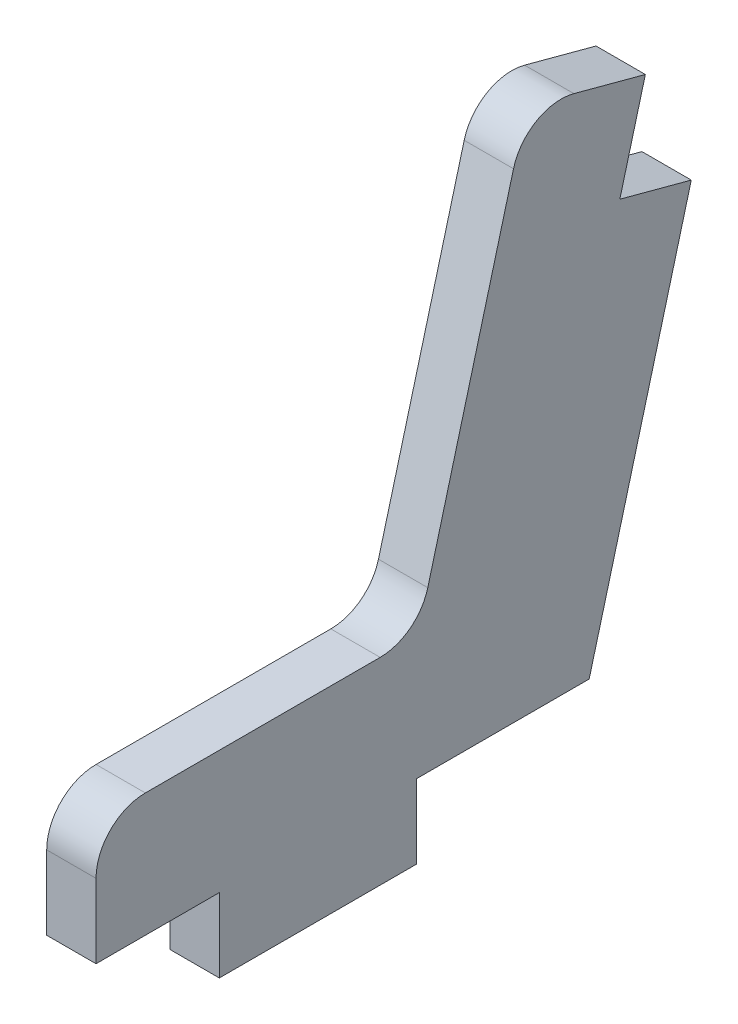
ISO-10303-21;
HEADER;
FILE_DESCRIPTION(('STEP AP214'),'2;1');
FILE_NAME('part.step','',(''),(''),'','','');
FILE_SCHEMA(('AUTOMOTIVE_DESIGN { 1 0 10303 214 1 1 1 1 }'));
ENDSEC;
DATA;
#1=APPLICATION_CONTEXT('core data for automotive mechanical design processes');
#2=APPLICATION_PROTOCOL_DEFINITION('international standard','automotive_design',2000,#1);
#3=PRODUCT_CONTEXT('',#1,'mechanical');
#4=PRODUCT('Part','Part','',(#3));
#5=PRODUCT_RELATED_PRODUCT_CATEGORY('part','',(#4));
#6=PRODUCT_DEFINITION_FORMATION('','',#4);
#7=PRODUCT_DEFINITION_CONTEXT('part definition',#1,'design');
#8=PRODUCT_DEFINITION('design','',#6,#7);
#9=PRODUCT_DEFINITION_SHAPE('','',#8);
#10=(LENGTH_UNIT() NAMED_UNIT(*) SI_UNIT(.MILLI.,.METRE.));
#11=(NAMED_UNIT(*) PLANE_ANGLE_UNIT() SI_UNIT($,.RADIAN.));
#12=(NAMED_UNIT(*) SI_UNIT($,.STERADIAN.) SOLID_ANGLE_UNIT());
#13=UNCERTAINTY_MEASURE_WITH_UNIT(LENGTH_MEASURE(1.E-05),#10,'distance_accuracy_value','');
#14=(GEOMETRIC_REPRESENTATION_CONTEXT(3) GLOBAL_UNCERTAINTY_ASSIGNED_CONTEXT((#13)) GLOBAL_UNIT_ASSIGNED_CONTEXT((#10,
#11,#12)) REPRESENTATION_CONTEXT('',''));
#15=CARTESIAN_POINT('',(0.,0.,0.));
#16=DIRECTION('',(0.,0.,1.));
#17=DIRECTION('',(1.,0.,0.));
#18=AXIS2_PLACEMENT_3D('',#15,#16,#17);
#19=CARTESIAN_POINT('',(2.,-7.70521967838386,20.5003652212126));
#20=DIRECTION('',(0.,0.,-1.));
#21=DIRECTION('',(-1.,0.,0.));
#22=AXIS2_PLACEMENT_3D('',#19,#20,#21);
#23=PLANE('',#22);
#24=DIRECTION('',(0.,-1.,0.));
#25=VECTOR('',#24,1.);
#26=CARTESIAN_POINT('',(2.,-7.70521967838386,20.5003652212126));
#27=LINE('',#26,#25);
#28=CARTESIAN_POINT('',(2.,-9.70521967838386,20.5003652212126));
#29=VERTEX_POINT('',#28);
#30=CARTESIAN_POINT('',(2.,-12.7052196783839,20.5003652212126));
#31=VERTEX_POINT('',#30);
#32=EDGE_CURVE('E144',#29,#31,#27,.T.);
#33=ORIENTED_EDGE('',*,*,#32,.F.);
#34=DIRECTION('',(-1.,0.,0.));
#35=VECTOR('',#34,1.);
#36=CARTESIAN_POINT('',(2.,-9.70521967838386,20.5003652212126));
#37=LINE('',#36,#35);
#38=CARTESIAN_POINT('',(0.,-9.70521967838386,20.5003652212126));
#39=VERTEX_POINT('',#38);
#40=EDGE_CURVE('E318',#29,#39,#37,.T.);
#41=ORIENTED_EDGE('',*,*,#40,.T.);
#42=DIRECTION('',(0.,-1.,0.));
#43=VECTOR('',#42,1.);
#44=CARTESIAN_POINT('',(0.,-7.70521967838386,20.5003652212126));
#45=LINE('',#44,#43);
#46=CARTESIAN_POINT('',(0.,-12.7052196783839,20.5003652212126));
#47=VERTEX_POINT('',#46);
#48=EDGE_CURVE('E170',#39,#47,#45,.T.);
#49=ORIENTED_EDGE('',*,*,#48,.T.);
#50=DIRECTION('',(-1.,0.,0.));
#51=VECTOR('',#50,1.);
#52=CARTESIAN_POINT('',(2.,-12.7052196783839,20.5003652212126));
#53=LINE('',#52,#51);
#54=EDGE_CURVE('E162',#31,#47,#53,.T.);
#55=ORIENTED_EDGE('',*,*,#54,.F.);
#56=EDGE_LOOP('',(#33,#41,#49,#55));
#57=FACE_BOUND('',#56,.T.);
#58=ADVANCED_FACE('F38',(#57),#23,.F.);
#59=CARTESIAN_POINT('',(2.,-12.7052196783839,20.5003652212126));
#60=DIRECTION('',(0.,1.,0.));
#61=DIRECTION('',(0.,0.,1.));
#62=AXIS2_PLACEMENT_3D('',#59,#60,#61);
#63=PLANE('',#62);
#64=DIRECTION('',(0.,0.,-1.));
#65=VECTOR('',#64,1.);
#66=CARTESIAN_POINT('',(0.,-12.7052196783839,20.5003652212126));
#67=LINE('',#66,#65);
#68=CARTESIAN_POINT('',(0.,-12.7052196783839,15.5003652212126));
#69=VERTEX_POINT('',#68);
#70=EDGE_CURVE('E248',#47,#69,#67,.T.);
#71=ORIENTED_EDGE('',*,*,#70,.T.);
#72=DIRECTION('',(-1.,0.,0.));
#73=VECTOR('',#72,1.);
#74=CARTESIAN_POINT('',(2.,-12.7052196783839,15.5003652212126));
#75=LINE('',#74,#73);
#76=CARTESIAN_POINT('',(2.,-12.7052196783839,15.5003652212126));
#77=VERTEX_POINT('',#76);
#78=EDGE_CURVE('E164',#77,#69,#75,.T.);
#79=ORIENTED_EDGE('',*,*,#78,.F.);
#80=DIRECTION('',(0.,0.,-1.));
#81=VECTOR('',#80,1.);
#82=CARTESIAN_POINT('',(2.,-12.7052196783839,20.5003652212126));
#83=LINE('',#82,#81);
#84=EDGE_CURVE('E148',#31,#77,#83,.T.);
#85=ORIENTED_EDGE('',*,*,#84,.F.);
#86=ORIENTED_EDGE('',*,*,#54,.T.);
#87=EDGE_LOOP('',(#71,#79,#85,#86));
#88=FACE_BOUND('',#87,.T.);
#89=ADVANCED_FACE('F161',(#88),#63,.F.);
#90=CARTESIAN_POINT('',(2.,-12.7052196783839,15.5003652212126));
#91=DIRECTION('',(0.,0.,-1.));
#92=DIRECTION('',(0.,1.,0.));
#93=AXIS2_PLACEMENT_3D('',#90,#91,#92);
#94=PLANE('',#93);
#95=DIRECTION('',(0.,-1.,0.));
#96=VECTOR('',#95,1.);
#97=CARTESIAN_POINT('',(0.,-12.7052196783839,15.5003652212126));
#98=LINE('',#97,#96);
#99=CARTESIAN_POINT('',(0.,-15.7052196783839,15.5003652212126));
#100=VERTEX_POINT('',#99);
#101=EDGE_CURVE('E250',#69,#100,#98,.T.);
#102=ORIENTED_EDGE('',*,*,#101,.T.);
#103=DIRECTION('',(-1.,0.,0.));
#104=VECTOR('',#103,1.);
#105=CARTESIAN_POINT('',(2.,-15.7052196783839,15.5003652212126));
#106=LINE('',#105,#104);
#107=CARTESIAN_POINT('',(2.,-15.7052196783839,15.5003652212126));
#108=VERTEX_POINT('',#107);
#109=EDGE_CURVE('E176',#108,#100,#106,.T.);
#110=ORIENTED_EDGE('',*,*,#109,.F.);
#111=DIRECTION('',(0.,-1.,0.));
#112=VECTOR('',#111,1.);
#113=CARTESIAN_POINT('',(2.,-12.7052196783839,15.5003652212126));
#114=LINE('',#113,#112);
#115=EDGE_CURVE('E167',#77,#108,#114,.T.);
#116=ORIENTED_EDGE('',*,*,#115,.F.);
#117=ORIENTED_EDGE('',*,*,#78,.T.);
#118=EDGE_LOOP('',(#102,#110,#116,#117));
#119=FACE_BOUND('',#118,.T.);
#120=ADVANCED_FACE('F331',(#119),#94,.F.);
#121=CARTESIAN_POINT('',(2.,-15.7052196783839,15.5003652212126));
#122=DIRECTION('',(0.,1.,0.));
#123=DIRECTION('',(0.,0.,1.));
#124=AXIS2_PLACEMENT_3D('',#121,#122,#123);
#125=PLANE('',#124);
#126=DIRECTION('',(0.,0.,-1.));
#127=VECTOR('',#126,1.);
#128=CARTESIAN_POINT('',(0.,-15.7052196783839,15.5003652212126));
#129=LINE('',#128,#127);
#130=CARTESIAN_POINT('',(0.,-15.7052196783839,7.50036522121258));
#131=VERTEX_POINT('',#130);
#132=EDGE_CURVE('E252',#100,#131,#129,.T.);
#133=ORIENTED_EDGE('',*,*,#132,.T.);
#134=DIRECTION('',(-1.,0.,0.));
#135=VECTOR('',#134,1.);
#136=CARTESIAN_POINT('',(2.,-15.7052196783839,7.50036522121258));
#137=LINE('',#136,#135);
#138=CARTESIAN_POINT('',(2.,-15.7052196783839,7.50036522121258));
#139=VERTEX_POINT('',#138);
#140=EDGE_CURVE('E285',#139,#131,#137,.T.);
#141=ORIENTED_EDGE('',*,*,#140,.F.);
#142=DIRECTION('',(0.,0.,-1.));
#143=VECTOR('',#142,1.);
#144=CARTESIAN_POINT('',(2.,-15.7052196783839,15.5003652212126));
#145=LINE('',#144,#143);
#146=EDGE_CURVE('E207',#108,#139,#145,.T.);
#147=ORIENTED_EDGE('',*,*,#146,.F.);
#148=ORIENTED_EDGE('',*,*,#109,.T.);
#149=EDGE_LOOP('',(#133,#141,#147,#148));
#150=FACE_BOUND('',#149,.T.);
#151=ADVANCED_FACE('F292',(#150),#125,.F.);
#152=CARTESIAN_POINT('',(2.,-15.7052196783839,7.50036522121258));
#153=DIRECTION('',(0.,0.,1.));
#154=DIRECTION('',(1.,0.,0.));
#155=AXIS2_PLACEMENT_3D('',#152,#153,#154);
#156=PLANE('',#155);
#157=DIRECTION('',(0.,1.,0.));
#158=VECTOR('',#157,1.);
#159=CARTESIAN_POINT('',(0.,-15.7052196783839,7.50036522121258));
#160=LINE('',#159,#158);
#161=CARTESIAN_POINT('',(0.,-12.7052196783839,7.50036522121258));
#162=VERTEX_POINT('',#161);
#163=EDGE_CURVE('E254',#131,#162,#160,.T.);
#164=ORIENTED_EDGE('',*,*,#163,.T.);
#165=DIRECTION('',(-1.,0.,0.));
#166=VECTOR('',#165,1.);
#167=CARTESIAN_POINT('',(2.,-12.7052196783839,7.50036522121258));
#168=LINE('',#167,#166);
#169=CARTESIAN_POINT('',(2.,-12.7052196783839,7.50036522121258));
#170=VERTEX_POINT('',#169);
#171=EDGE_CURVE('E282',#170,#162,#168,.T.);
#172=ORIENTED_EDGE('',*,*,#171,.F.);
#173=DIRECTION('',(0.,1.,0.));
#174=VECTOR('',#173,1.);
#175=CARTESIAN_POINT('',(2.,-15.7052196783839,7.50036522121258));
#176=LINE('',#175,#174);
#177=EDGE_CURVE('E215',#139,#170,#176,.T.);
#178=ORIENTED_EDGE('',*,*,#177,.F.);
#179=ORIENTED_EDGE('',*,*,#140,.T.);
#180=EDGE_LOOP('',(#164,#172,#178,#179));
#181=FACE_BOUND('',#180,.T.);
#182=ADVANCED_FACE('F304',(#181),#156,.F.);
#183=CARTESIAN_POINT('',(2.,-12.7052196783839,7.50036522121258));
#184=DIRECTION('',(0.,1.,0.));
#185=DIRECTION('',(0.,0.,1.));
#186=AXIS2_PLACEMENT_3D('',#183,#184,#185);
#187=PLANE('',#186);
#188=DIRECTION('',(0.,0.,-1.));
#189=VECTOR('',#188,1.);
#190=CARTESIAN_POINT('',(0.,-12.7052196783839,7.50036522121258));
#191=LINE('',#190,#189);
#192=CARTESIAN_POINT('',(0.,-12.7052196783839,0.500365221212583));
#193=VERTEX_POINT('',#192);
#194=EDGE_CURVE('E256',#162,#193,#191,.T.);
#195=ORIENTED_EDGE('',*,*,#194,.T.);
#196=DIRECTION('',(-1.,0.,0.));
#197=VECTOR('',#196,1.);
#198=CARTESIAN_POINT('',(2.,-12.7052196783839,0.500365221212583));
#199=LINE('',#198,#197);
#200=CARTESIAN_POINT('',(2.,-12.7052196783839,0.500365221212583));
#201=VERTEX_POINT('',#200);
#202=EDGE_CURVE('E279',#201,#193,#199,.T.);
#203=ORIENTED_EDGE('',*,*,#202,.F.);
#204=DIRECTION('',(0.,0.,-1.));
#205=VECTOR('',#204,1.);
#206=CARTESIAN_POINT('',(2.,-12.7052196783839,7.50036522121258));
#207=LINE('',#206,#205);
#208=EDGE_CURVE('E218',#170,#201,#207,.T.);
#209=ORIENTED_EDGE('',*,*,#208,.F.);
#210=ORIENTED_EDGE('',*,*,#171,.T.);
#211=EDGE_LOOP('',(#195,#203,#209,#210));
#212=FACE_BOUND('',#211,.T.);
#213=ADVANCED_FACE('F308',(#212),#187,.F.);
#214=CARTESIAN_POINT('',(2.,-12.7052196783839,0.500365221212583));
#215=DIRECTION('',(0.,0.258819045102518,0.965925826289069));
#216=DIRECTION('',(0.,-0.965925826289069,0.258819045102518));
#217=AXIS2_PLACEMENT_3D('',#214,#215,#216);
#218=PLANE('',#217);
#219=DIRECTION('',(0.,0.965925826289069,-0.258819045102518));
#220=VECTOR('',#219,1.);
#221=CARTESIAN_POINT('',(0.,-12.7052196783839,0.500365221212583));
#222=LINE('',#221,#220);
#223=CARTESIAN_POINT('',(0.,2.74959354224125,-3.6407395004277));
#224=VERTEX_POINT('',#223);
#225=EDGE_CURVE('E258',#193,#224,#222,.T.);
#226=ORIENTED_EDGE('',*,*,#225,.T.);
#227=DIRECTION('',(-1.,0.,0.));
#228=VECTOR('',#227,1.);
#229=CARTESIAN_POINT('',(2.,2.74959354224125,-3.6407395004277));
#230=LINE('',#229,#228);
#231=CARTESIAN_POINT('',(2.,2.74959354224125,-3.6407395004277));
#232=VERTEX_POINT('',#231);
#233=EDGE_CURVE('E276',#232,#224,#230,.T.);
#234=ORIENTED_EDGE('',*,*,#233,.F.);
#235=DIRECTION('',(0.,0.965925826289069,-0.258819045102518));
#236=VECTOR('',#235,1.);
#237=CARTESIAN_POINT('',(2.,-12.7052196783839,0.500365221212583));
#238=LINE('',#237,#236);
#239=EDGE_CURVE('E222',#201,#232,#238,.T.);
#240=ORIENTED_EDGE('',*,*,#239,.F.);
#241=ORIENTED_EDGE('',*,*,#202,.T.);
#242=EDGE_LOOP('',(#226,#234,#240,#241));
#243=FACE_BOUND('',#242,.T.);
#244=ADVANCED_FACE('F431',(#243),#218,.F.);
#245=CARTESIAN_POINT('',(2.,2.74959354224125,-3.6407395004277));
#246=DIRECTION('',(0.,-0.965925826289069,0.258819045102518));
#247=DIRECTION('',(0.,-0.258819045102518,-0.965925826289069));
#248=AXIS2_PLACEMENT_3D('',#245,#246,#247);
#249=PLANE('',#248);
#250=DIRECTION('',(0.,0.258819045102518,0.965925826289069));
#251=VECTOR('',#250,1.);
#252=CARTESIAN_POINT('',(0.,2.74959354224125,-3.6407395004277));
#253=LINE('',#252,#251);
#254=CARTESIAN_POINT('',(0.,3.5260506775488,-0.742962021560494));
#255=VERTEX_POINT('',#254);
#256=EDGE_CURVE('E260',#224,#255,#253,.T.);
#257=ORIENTED_EDGE('',*,*,#256,.T.);
#258=DIRECTION('',(-1.,0.,0.));
#259=VECTOR('',#258,1.);
#260=CARTESIAN_POINT('',(2.,3.5260506775488,-0.742962021560494));
#261=LINE('',#260,#259);
#262=CARTESIAN_POINT('',(2.,3.5260506775488,-0.742962021560494));
#263=VERTEX_POINT('',#262);
#264=EDGE_CURVE('E273',#263,#255,#261,.T.);
#265=ORIENTED_EDGE('',*,*,#264,.F.);
#266=DIRECTION('',(0.,0.258819045102518,0.965925826289069));
#267=VECTOR('',#266,1.);
#268=CARTESIAN_POINT('',(2.,2.74959354224125,-3.6407395004277));
#269=LINE('',#268,#267);
#270=EDGE_CURVE('E226',#232,#263,#269,.T.);
#271=ORIENTED_EDGE('',*,*,#270,.F.);
#272=ORIENTED_EDGE('',*,*,#233,.T.);
#273=EDGE_LOOP('',(#257,#265,#271,#272));
#274=FACE_BOUND('',#273,.T.);
#275=ADVANCED_FACE('F421',(#274),#249,.F.);
#276=CARTESIAN_POINT('',(2.,3.5260506775488,-0.742962021560494));
#277=DIRECTION('',(0.,0.258819045102518,0.965925826289069));
#278=DIRECTION('',(0.,-0.965925826289069,0.258819045102518));
#279=AXIS2_PLACEMENT_3D('',#276,#277,#278);
#280=PLANE('',#279);
#281=DIRECTION('',(0.,0.965925826289069,-0.258819045102518));
#282=VECTOR('',#281,1.);
#283=CARTESIAN_POINT('',(0.,3.5260506775488,-0.742962021560494));
#284=LINE('',#283,#282);
#285=CARTESIAN_POINT('',(0.,7.38975398270508,-1.77823820197056));
#286=VERTEX_POINT('',#285);
#287=EDGE_CURVE('E262',#255,#286,#284,.T.);
#288=ORIENTED_EDGE('',*,*,#287,.T.);
#289=DIRECTION('',(-1.,0.,0.));
#290=VECTOR('',#289,1.);
#291=CARTESIAN_POINT('',(2.,7.38975398270508,-1.77823820197056));
#292=LINE('',#291,#290);
#293=CARTESIAN_POINT('',(2.,7.38975398270508,-1.77823820197056));
#294=VERTEX_POINT('',#293);
#295=EDGE_CURVE('E246',#294,#286,#292,.T.);
#296=ORIENTED_EDGE('',*,*,#295,.F.);
#297=DIRECTION('',(0.,0.965925826289069,-0.258819045102518));
#298=VECTOR('',#297,1.);
#299=CARTESIAN_POINT('',(2.,3.5260506775488,-0.742962021560494));
#300=LINE('',#299,#298);
#301=EDGE_CURVE('E229',#263,#294,#300,.T.);
#302=ORIENTED_EDGE('',*,*,#301,.F.);
#303=ORIENTED_EDGE('',*,*,#264,.T.);
#304=EDGE_LOOP('',(#288,#296,#302,#303));
#305=FACE_BOUND('',#304,.T.);
#306=ADVANCED_FACE('F405',(#305),#280,.F.);
#307=CARTESIAN_POINT('',(2.,7.38975398270508,-1.77823820197056));
#308=DIRECTION('',(0.,-0.965925826289069,0.258819045102518));
#309=DIRECTION('',(0.,-0.258819045102518,-0.965925826289069));
#310=AXIS2_PLACEMENT_3D('',#307,#308,#309);
#311=PLANE('',#310);
#312=DIRECTION('',(0.,0.258819045102518,0.965925826289069));
#313=VECTOR('',#312,1.);
#314=CARTESIAN_POINT('',(0.,7.38975398270508,-1.77823820197056));
#315=LINE('',#314,#313);
#316=CARTESIAN_POINT('',(0.,8.16621111801263,1.11953927689664));
#317=VERTEX_POINT('',#316);
#318=EDGE_CURVE('E264',#286,#317,#315,.T.);
#319=ORIENTED_EDGE('',*,*,#318,.T.);
#320=DIRECTION('',(-1.,0.,0.));
#321=VECTOR('',#320,1.);
#322=CARTESIAN_POINT('',(2.,8.16621111801263,1.11953927689664));
#323=LINE('',#322,#321);
#324=CARTESIAN_POINT('',(2.,8.16621111801263,1.11953927689664));
#325=VERTEX_POINT('',#324);
#326=EDGE_CURVE('E186',#317,#325,#323,.F.);
#327=ORIENTED_EDGE('',*,*,#326,.T.);
#328=DIRECTION('',(0.,0.258819045102518,0.965925826289069));
#329=VECTOR('',#328,1.);
#330=CARTESIAN_POINT('',(2.,7.38975398270508,-1.77823820197056));
#331=LINE('',#330,#329);
#332=EDGE_CURVE('E233',#294,#325,#331,.T.);
#333=ORIENTED_EDGE('',*,*,#332,.F.);
#334=ORIENTED_EDGE('',*,*,#295,.T.);
#335=EDGE_LOOP('',(#319,#327,#333,#334));
#336=FACE_BOUND('',#335,.T.);
#337=ADVANCED_FACE('F397',(#336),#311,.F.);
#338=CARTESIAN_POINT('',(2.,8.68384920821767,3.05139092947478));
#339=DIRECTION('',(0.,-0.258819045102517,-0.965925826289069));
#340=DIRECTION('',(0.,0.965925826289069,-0.258819045102517));
#341=AXIS2_PLACEMENT_3D('',#338,#339,#340);
#342=PLANE('',#341);
#343=DIRECTION('',(0.,-0.965925826289069,0.258819045102517));
#344=VECTOR('',#343,1.);
#345=CARTESIAN_POINT('',(2.,8.68384920821767,3.05139092947478));
#346=LINE('',#345,#344);
#347=CARTESIAN_POINT('',(2.,6.75199755563953,3.56902901967982));
#348=VERTEX_POINT('',#347);
#349=CARTESIAN_POINT('',(2.,-6.2228577685889,7.04563102571742));
#350=VERTEX_POINT('',#349);
#351=EDGE_CURVE('E237',#348,#350,#346,.T.);
#352=ORIENTED_EDGE('',*,*,#351,.F.);
#353=DIRECTION('',(-1.,0.,0.));
#354=VECTOR('',#353,1.);
#355=CARTESIAN_POINT('',(2.,6.75199755563953,3.56902901967982));
#356=LINE('',#355,#354);
#357=CARTESIAN_POINT('',(0.,6.75199755563953,3.56902901967982));
#358=VERTEX_POINT('',#357);
#359=EDGE_CURVE('E174',#348,#358,#356,.T.);
#360=ORIENTED_EDGE('',*,*,#359,.T.);
#361=DIRECTION('',(0.,-0.965925826289069,0.258819045102517));
#362=VECTOR('',#361,1.);
#363=CARTESIAN_POINT('',(0.,8.68384920821767,3.05139092947478));
#364=LINE('',#363,#362);
#365=CARTESIAN_POINT('',(0.,-6.2228577685889,7.04563102571742));
#366=VERTEX_POINT('',#365);
#367=EDGE_CURVE('E267',#358,#366,#364,.T.);
#368=ORIENTED_EDGE('',*,*,#367,.T.);
#369=DIRECTION('',(-1.,0.,0.));
#370=VECTOR('',#369,1.);
#371=CARTESIAN_POINT('',(2.,-6.22285776858889,7.04563102571742));
#372=LINE('',#371,#370);
#373=EDGE_CURVE('E172',#366,#350,#372,.F.);
#374=ORIENTED_EDGE('',*,*,#373,.T.);
#375=EDGE_LOOP('',(#352,#360,#368,#374));
#376=FACE_BOUND('',#375,.T.);
#377=ADVANCED_FACE('F326',(#376),#342,.F.);
#378=CARTESIAN_POINT('',(2.,-7.70521967838386,7.44282870233763));
#379=DIRECTION('',(0.,-1.,0.));
#380=DIRECTION('',(0.,0.,-1.));
#381=AXIS2_PLACEMENT_3D('',#378,#379,#380);
#382=PLANE('',#381);
#383=DIRECTION('',(0.,0.,1.));
#384=VECTOR('',#383,1.);
#385=CARTESIAN_POINT('',(2.,-7.70521967838386,7.44282870233763));
#386=LINE('',#385,#384);
#387=CARTESIAN_POINT('',(2.,-7.70521967838386,8.97748267829556));
#388=VERTEX_POINT('',#387);
#389=CARTESIAN_POINT('',(2.,-7.70521967838386,18.5003652212126));
#390=VERTEX_POINT('',#389);
#391=EDGE_CURVE('E242',#388,#390,#386,.T.);
#392=ORIENTED_EDGE('',*,*,#391,.F.);
#393=DIRECTION('',(-1.,0.,0.));
#394=VECTOR('',#393,1.);
#395=CARTESIAN_POINT('',(0.,-7.70521967838386,8.97748267829556));
#396=LINE('',#395,#394);
#397=CARTESIAN_POINT('',(0.,-7.70521967838386,8.97748267829556));
#398=VERTEX_POINT('',#397);
#399=EDGE_CURVE('E316',#388,#398,#396,.T.);
#400=ORIENTED_EDGE('',*,*,#399,.T.);
#401=DIRECTION('',(0.,0.,1.));
#402=VECTOR('',#401,1.);
#403=CARTESIAN_POINT('',(0.,-7.70521967838386,7.44282870233763));
#404=LINE('',#403,#402);
#405=CARTESIAN_POINT('',(0.,-7.70521967838386,18.5003652212126));
#406=VERTEX_POINT('',#405);
#407=EDGE_CURVE('E157',#398,#406,#404,.T.);
#408=ORIENTED_EDGE('',*,*,#407,.T.);
#409=DIRECTION('',(-1.,0.,0.));
#410=VECTOR('',#409,1.);
#411=CARTESIAN_POINT('',(2.,-7.70521967838386,18.5003652212126));
#412=LINE('',#411,#410);
#413=EDGE_CURVE('E54',#406,#390,#412,.F.);
#414=ORIENTED_EDGE('',*,*,#413,.T.);
#415=EDGE_LOOP('',(#392,#400,#408,#414));
#416=FACE_BOUND('',#415,.T.);
#417=ADVANCED_FACE('F329',(#416),#382,.F.);
#418=CARTESIAN_POINT('',(2.,0.,0.));
#419=DIRECTION('',(1.,0.,0.));
#420=DIRECTION('',(0.,0.,-1.));
#421=AXIS2_PLACEMENT_3D('',#418,#419,#420);
#422=PLANE('',#421);
#423=ORIENTED_EDGE('',*,*,#332,.T.);
#424=CARTESIAN_POINT('',(2.,6.23435946543449,1.63717736710168));
#425=DIRECTION('',(1.,0.,0.));
#426=DIRECTION('',(0.,0.,-1.));
#427=AXIS2_PLACEMENT_3D('',#424,#425,#426);
#428=CIRCLE('',#427,2.);
#429=EDGE_CURVE('E191',#325,#348,#428,.T.);
#430=ORIENTED_EDGE('',*,*,#429,.T.);
#431=ORIENTED_EDGE('',*,*,#351,.T.);
#432=CARTESIAN_POINT('',(2.,-5.70521967838386,8.97748267829556));
#433=DIRECTION('',(1.,0.,0.));
#434=DIRECTION('',(0.,0.,-1.));
#435=AXIS2_PLACEMENT_3D('',#432,#433,#434);
#436=CIRCLE('',#435,2.);
#437=EDGE_CURVE('E12',#350,#388,#436,.F.);
#438=ORIENTED_EDGE('',*,*,#437,.T.);
#439=ORIENTED_EDGE('',*,*,#391,.T.);
#440=CARTESIAN_POINT('',(2.,-9.70521967838386,18.5003652212126));
#441=DIRECTION('',(1.,0.,0.));
#442=DIRECTION('',(0.,0.,-1.));
#443=AXIS2_PLACEMENT_3D('',#440,#441,#442);
#444=CIRCLE('',#443,2.);
#445=EDGE_CURVE('E151',#390,#29,#444,.T.);
#446=ORIENTED_EDGE('',*,*,#445,.T.);
#447=ORIENTED_EDGE('',*,*,#32,.T.);
#448=ORIENTED_EDGE('',*,*,#84,.T.);
#449=ORIENTED_EDGE('',*,*,#115,.T.);
#450=ORIENTED_EDGE('',*,*,#146,.T.);
#451=ORIENTED_EDGE('',*,*,#177,.T.);
#452=ORIENTED_EDGE('',*,*,#208,.T.);
#453=ORIENTED_EDGE('',*,*,#239,.T.);
#454=ORIENTED_EDGE('',*,*,#270,.T.);
#455=ORIENTED_EDGE('',*,*,#301,.T.);
#456=EDGE_LOOP('',(#423,#430,#431,#438,#439,#446,#447,#448,#449,#450,#451,#452,#453,#454,#455));
#457=FACE_BOUND('',#456,.T.);
#458=ADVANCED_FACE('F147',(#457),#422,.T.);
#459=CARTESIAN_POINT('',(0.,0.,0.));
#460=DIRECTION('',(1.,0.,0.));
#461=DIRECTION('',(0.,0.,-1.));
#462=AXIS2_PLACEMENT_3D('',#459,#460,#461);
#463=PLANE('',#462);
#464=ORIENTED_EDGE('',*,*,#367,.F.);
#465=CARTESIAN_POINT('',(0.,6.23435946543449,1.63717736710168));
#466=DIRECTION('',(1.,0.,0.));
#467=DIRECTION('',(0.,0.,-1.));
#468=AXIS2_PLACEMENT_3D('',#465,#466,#467);
#469=CIRCLE('',#468,2.);
#470=EDGE_CURVE('E184',#358,#317,#469,.F.);
#471=ORIENTED_EDGE('',*,*,#470,.T.);
#472=ORIENTED_EDGE('',*,*,#318,.F.);
#473=ORIENTED_EDGE('',*,*,#287,.F.);
#474=ORIENTED_EDGE('',*,*,#256,.F.);
#475=ORIENTED_EDGE('',*,*,#225,.F.);
#476=ORIENTED_EDGE('',*,*,#194,.F.);
#477=ORIENTED_EDGE('',*,*,#163,.F.);
#478=ORIENTED_EDGE('',*,*,#132,.F.);
#479=ORIENTED_EDGE('',*,*,#101,.F.);
#480=ORIENTED_EDGE('',*,*,#70,.F.);
#481=ORIENTED_EDGE('',*,*,#48,.F.);
#482=CARTESIAN_POINT('',(0.,-9.70521967838386,18.5003652212126));
#483=DIRECTION('',(1.,0.,0.));
#484=DIRECTION('',(0.,0.,-1.));
#485=AXIS2_PLACEMENT_3D('',#482,#483,#484);
#486=CIRCLE('',#485,2.);
#487=EDGE_CURVE('E182',#39,#406,#486,.F.);
#488=ORIENTED_EDGE('',*,*,#487,.T.);
#489=ORIENTED_EDGE('',*,*,#407,.F.);
#490=CARTESIAN_POINT('',(0.,-5.70521967838386,8.97748267829556));
#491=DIRECTION('',(1.,0.,0.));
#492=DIRECTION('',(0.,0.,-1.));
#493=AXIS2_PLACEMENT_3D('',#490,#491,#492);
#494=CIRCLE('',#493,2.);
#495=EDGE_CURVE('E47',#398,#366,#494,.T.);
#496=ORIENTED_EDGE('',*,*,#495,.T.);
#497=EDGE_LOOP('',(#464,#471,#472,#473,#474,#475,#476,#477,#478,#479,#480,#481,#488,#489,#496));
#498=FACE_BOUND('',#497,.T.);
#499=ADVANCED_FACE('F299',(#498),#463,.F.);
#500=CARTESIAN_POINT('',(2.,6.23435946543449,1.63717736710168));
#501=DIRECTION('',(-1.,0.,0.));
#502=DIRECTION('',(0.,0.,1.));
#503=AXIS2_PLACEMENT_3D('',#500,#501,#502);
#504=CYLINDRICAL_SURFACE('',#503,2.);
#505=ORIENTED_EDGE('',*,*,#429,.F.);
#506=ORIENTED_EDGE('',*,*,#326,.F.);
#507=ORIENTED_EDGE('',*,*,#470,.F.);
#508=ORIENTED_EDGE('',*,*,#359,.F.);
#509=EDGE_LOOP('',(#505,#506,#507,#508));
#510=FACE_BOUND('',#509,.T.);
#511=ADVANCED_FACE('F345',(#510),#504,.T.);
#512=CARTESIAN_POINT('',(2.,-5.70521967838386,8.97748267829556));
#513=DIRECTION('',(1.,0.,0.));
#514=DIRECTION('',(0.,0.,-1.));
#515=AXIS2_PLACEMENT_3D('',#512,#513,#514);
#516=CYLINDRICAL_SURFACE('',#515,2.);
#517=ORIENTED_EDGE('',*,*,#437,.F.);
#518=ORIENTED_EDGE('',*,*,#373,.F.);
#519=ORIENTED_EDGE('',*,*,#495,.F.);
#520=ORIENTED_EDGE('',*,*,#399,.F.);
#521=EDGE_LOOP('',(#517,#518,#519,#520));
#522=FACE_BOUND('',#521,.T.);
#523=ADVANCED_FACE('F328',(#522),#516,.F.);
#524=CARTESIAN_POINT('',(2.,-9.70521967838386,18.5003652212126));
#525=DIRECTION('',(-1.,0.,0.));
#526=DIRECTION('',(0.,0.,1.));
#527=AXIS2_PLACEMENT_3D('',#524,#525,#526);
#528=CYLINDRICAL_SURFACE('',#527,2.);
#529=ORIENTED_EDGE('',*,*,#445,.F.);
#530=ORIENTED_EDGE('',*,*,#413,.F.);
#531=ORIENTED_EDGE('',*,*,#487,.F.);
#532=ORIENTED_EDGE('',*,*,#40,.F.);
#533=EDGE_LOOP('',(#529,#530,#531,#532));
#534=FACE_BOUND('',#533,.T.);
#535=ADVANCED_FACE('F40',(#534),#528,.T.);
#536=CLOSED_SHELL('',(#58,#89,#120,#151,#182,#213,#244,#275,#306,#337,#377,#417,#458,#499,#511,
#523,#535));
#537=MANIFOLD_SOLID_BREP('B2',#536);
#538=ADVANCED_BREP_SHAPE_REPRESENTATION('',(#18,#537),#14);
#539=SHAPE_DEFINITION_REPRESENTATION(#9,#538);
ENDSEC;
END-ISO-10303-21;
